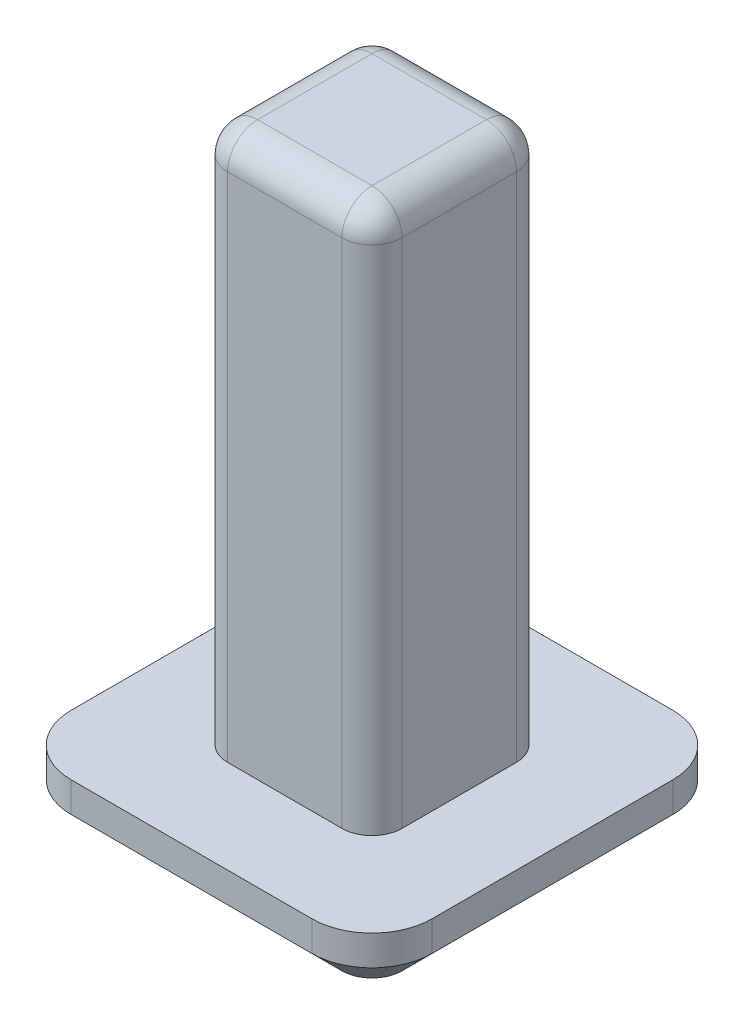
ISO-10303-21;
HEADER;
FILE_DESCRIPTION(('STEP AP214'),'2;1');
FILE_NAME('part.step','',(''),(''),'','','');
FILE_SCHEMA(('AUTOMOTIVE_DESIGN { 1 0 10303 214 1 1 1 1 }'));
ENDSEC;
DATA;
#1=APPLICATION_CONTEXT('core data for automotive mechanical design processes');
#2=APPLICATION_PROTOCOL_DEFINITION('international standard','automotive_design',2000,#1);
#3=PRODUCT_CONTEXT('',#1,'mechanical');
#4=PRODUCT('Part','Part','',(#3));
#5=PRODUCT_RELATED_PRODUCT_CATEGORY('part','',(#4));
#6=PRODUCT_DEFINITION_FORMATION('','',#4);
#7=PRODUCT_DEFINITION_CONTEXT('part definition',#1,'design');
#8=PRODUCT_DEFINITION('design','',#6,#7);
#9=PRODUCT_DEFINITION_SHAPE('','',#8);
#10=(LENGTH_UNIT() NAMED_UNIT(*) SI_UNIT(.MILLI.,.METRE.));
#11=(NAMED_UNIT(*) PLANE_ANGLE_UNIT() SI_UNIT($,.RADIAN.));
#12=(NAMED_UNIT(*) SI_UNIT($,.STERADIAN.) SOLID_ANGLE_UNIT());
#13=UNCERTAINTY_MEASURE_WITH_UNIT(LENGTH_MEASURE(1.E-05),#10,'distance_accuracy_value','');
#14=(GEOMETRIC_REPRESENTATION_CONTEXT(3) GLOBAL_UNCERTAINTY_ASSIGNED_CONTEXT((#13)) GLOBAL_UNIT_ASSIGNED_CONTEXT((#10,
#11,#12)) REPRESENTATION_CONTEXT('',''));
#15=CARTESIAN_POINT('',(0.,0.,0.));
#16=DIRECTION('',(0.,0.,1.));
#17=DIRECTION('',(1.,0.,0.));
#18=AXIS2_PLACEMENT_3D('',#15,#16,#17);
#19=CARTESIAN_POINT('',(0.,1.,0.));
#20=DIRECTION('',(0.,-1.,0.));
#21=DIRECTION('',(0.,0.,-1.));
#22=AXIS2_PLACEMENT_3D('',#19,#20,#21);
#23=PLANE('',#22);
#24=DIRECTION('',(0.,0.,1.));
#25=VECTOR('',#24,1.);
#26=CARTESIAN_POINT('',(-3.,1.,3.));
#27=LINE('',#26,#25);
#28=CARTESIAN_POINT('',(-3.,1.,-2.));
#29=VERTEX_POINT('',#28);
#30=CARTESIAN_POINT('',(-3.,1.,2.));
#31=VERTEX_POINT('',#30);
#32=EDGE_CURVE('E198',#29,#31,#27,.T.);
#33=ORIENTED_EDGE('',*,*,#32,.T.);
#34=CARTESIAN_POINT('',(-2.,1.,2.));
#35=DIRECTION('',(0.,-1.,0.));
#36=DIRECTION('',(0.,0.,-1.));
#37=AXIS2_PLACEMENT_3D('',#34,#35,#36);
#38=CIRCLE('',#37,1.);
#39=CARTESIAN_POINT('',(-2.,1.,3.));
#40=VERTEX_POINT('',#39);
#41=EDGE_CURVE('E192',#31,#40,#38,.F.);
#42=ORIENTED_EDGE('',*,*,#41,.T.);
#43=DIRECTION('',(1.,0.,0.));
#44=VECTOR('',#43,1.);
#45=CARTESIAN_POINT('',(-3.,1.,3.));
#46=LINE('',#45,#44);
#47=CARTESIAN_POINT('',(2.,1.,3.));
#48=VERTEX_POINT('',#47);
#49=EDGE_CURVE('E195',#40,#48,#46,.T.);
#50=ORIENTED_EDGE('',*,*,#49,.T.);
#51=CARTESIAN_POINT('',(2.,1.,2.));
#52=DIRECTION('',(0.,-1.,0.));
#53=DIRECTION('',(0.,0.,-1.));
#54=AXIS2_PLACEMENT_3D('',#51,#52,#53);
#55=CIRCLE('',#54,1.);
#56=CARTESIAN_POINT('',(3.,1.,2.));
#57=VERTEX_POINT('',#56);
#58=EDGE_CURVE('E215',#48,#57,#55,.F.);
#59=ORIENTED_EDGE('',*,*,#58,.T.);
#60=DIRECTION('',(0.,0.,-1.));
#61=VECTOR('',#60,1.);
#62=CARTESIAN_POINT('',(3.,1.,3.));
#63=LINE('',#62,#61);
#64=CARTESIAN_POINT('',(3.,1.,-2.));
#65=VERTEX_POINT('',#64);
#66=EDGE_CURVE('E391',#57,#65,#63,.T.);
#67=ORIENTED_EDGE('',*,*,#66,.T.);
#68=CARTESIAN_POINT('',(2.,1.,-2.));
#69=DIRECTION('',(0.,-1.,0.));
#70=DIRECTION('',(0.,0.,-1.));
#71=AXIS2_PLACEMENT_3D('',#68,#69,#70);
#72=CIRCLE('',#71,1.);
#73=CARTESIAN_POINT('',(2.,1.,-3.));
#74=VERTEX_POINT('',#73);
#75=EDGE_CURVE('E217',#65,#74,#72,.F.);
#76=ORIENTED_EDGE('',*,*,#75,.T.);
#77=DIRECTION('',(-1.,0.,0.));
#78=VECTOR('',#77,1.);
#79=CARTESIAN_POINT('',(-3.,1.,-3.));
#80=LINE('',#79,#78);
#81=CARTESIAN_POINT('',(-2.,1.,-3.));
#82=VERTEX_POINT('',#81);
#83=EDGE_CURVE('E389',#74,#82,#80,.T.);
#84=ORIENTED_EDGE('',*,*,#83,.T.);
#85=CARTESIAN_POINT('',(-2.,1.,-2.));
#86=DIRECTION('',(0.,-1.,0.));
#87=DIRECTION('',(0.,0.,-1.));
#88=AXIS2_PLACEMENT_3D('',#85,#86,#87);
#89=CIRCLE('',#88,1.);
#90=EDGE_CURVE('E200',#82,#29,#89,.F.);
#91=ORIENTED_EDGE('',*,*,#90,.T.);
#92=EDGE_LOOP('',(#33,#42,#50,#59,#67,#76,#84,#91));
#93=FACE_BOUND('',#92,.T.);
#94=DIRECTION('',(0.,0.,-1.));
#95=VECTOR('',#94,1.);
#96=CARTESIAN_POINT('',(1.45,1.,1.45));
#97=LINE('',#96,#95);
#98=CARTESIAN_POINT('',(1.45,1.,0.95));
#99=VERTEX_POINT('',#98);
#100=CARTESIAN_POINT('',(1.45,1.,-0.95));
#101=VERTEX_POINT('',#100);
#102=EDGE_CURVE('E306',#99,#101,#97,.T.);
#103=ORIENTED_EDGE('',*,*,#102,.F.);
#104=CARTESIAN_POINT('',(0.95,1.,0.95));
#105=DIRECTION('',(0.,-1.,0.));
#106=DIRECTION('',(0.,0.,-1.));
#107=AXIS2_PLACEMENT_3D('',#104,#105,#106);
#108=CIRCLE('',#107,0.5);
#109=CARTESIAN_POINT('',(0.95,1.,1.45));
#110=VERTEX_POINT('',#109);
#111=EDGE_CURVE('E253',#99,#110,#108,.T.);
#112=ORIENTED_EDGE('',*,*,#111,.T.);
#113=DIRECTION('',(1.,0.,0.));
#114=VECTOR('',#113,1.);
#115=CARTESIAN_POINT('',(-1.45,1.,1.45));
#116=LINE('',#115,#114);
#117=CARTESIAN_POINT('',(-0.95,1.,1.45));
#118=VERTEX_POINT('',#117);
#119=EDGE_CURVE('E395',#118,#110,#116,.T.);
#120=ORIENTED_EDGE('',*,*,#119,.F.);
#121=CARTESIAN_POINT('',(-0.95,1.,0.95));
#122=DIRECTION('',(0.,-1.,0.));
#123=DIRECTION('',(0.,0.,-1.));
#124=AXIS2_PLACEMENT_3D('',#121,#122,#123);
#125=CIRCLE('',#124,0.5);
#126=CARTESIAN_POINT('',(-1.45,1.,0.95));
#127=VERTEX_POINT('',#126);
#128=EDGE_CURVE('E255',#118,#127,#125,.T.);
#129=ORIENTED_EDGE('',*,*,#128,.T.);
#130=DIRECTION('',(0.,0.,1.));
#131=VECTOR('',#130,1.);
#132=CARTESIAN_POINT('',(-1.45,1.,1.45));
#133=LINE('',#132,#131);
#134=CARTESIAN_POINT('',(-1.45,1.,-0.95));
#135=VERTEX_POINT('',#134);
#136=EDGE_CURVE('E400',#135,#127,#133,.T.);
#137=ORIENTED_EDGE('',*,*,#136,.F.);
#138=CARTESIAN_POINT('',(-0.95,1.,-0.95));
#139=DIRECTION('',(0.,-1.,0.));
#140=DIRECTION('',(0.,0.,-1.));
#141=AXIS2_PLACEMENT_3D('',#138,#139,#140);
#142=CIRCLE('',#141,0.5);
#143=CARTESIAN_POINT('',(-0.95,1.,-1.45));
#144=VERTEX_POINT('',#143);
#145=EDGE_CURVE('E251',#135,#144,#142,.T.);
#146=ORIENTED_EDGE('',*,*,#145,.T.);
#147=DIRECTION('',(-1.,0.,0.));
#148=VECTOR('',#147,1.);
#149=CARTESIAN_POINT('',(-1.45,1.,-1.45));
#150=LINE('',#149,#148);
#151=CARTESIAN_POINT('',(0.95,1.,-1.45));
#152=VERTEX_POINT('',#151);
#153=EDGE_CURVE('E403',#152,#144,#150,.T.);
#154=ORIENTED_EDGE('',*,*,#153,.F.);
#155=CARTESIAN_POINT('',(0.95,1.,-0.95));
#156=DIRECTION('',(0.,-1.,0.));
#157=DIRECTION('',(0.,0.,-1.));
#158=AXIS2_PLACEMENT_3D('',#155,#156,#157);
#159=CIRCLE('',#158,0.5);
#160=EDGE_CURVE('E249',#152,#101,#159,.T.);
#161=ORIENTED_EDGE('',*,*,#160,.T.);
#162=EDGE_LOOP('',(#103,#112,#120,#129,#137,#146,#154,#161));
#163=FACE_BOUND('',#162,.T.);
#164=ADVANCED_FACE('F40',(#93,#163),#23,.F.);
#165=CARTESIAN_POINT('',(3.,1.,3.));
#166=DIRECTION('',(-1.,0.,0.));
#167=DIRECTION('',(0.,0.,1.));
#168=AXIS2_PLACEMENT_3D('',#165,#166,#167);
#169=PLANE('',#168);
#170=DIRECTION('',(0.,-1.,0.));
#171=VECTOR('',#170,1.);
#172=CARTESIAN_POINT('',(3.,1.,2.));
#173=LINE('',#172,#171);
#174=CARTESIAN_POINT('',(3.,0.499999999999999,2.));
#175=VERTEX_POINT('',#174);
#176=EDGE_CURVE('E224',#57,#175,#173,.T.);
#177=ORIENTED_EDGE('',*,*,#176,.T.);
#178=DIRECTION('',(0.,0.,-1.));
#179=VECTOR('',#178,1.);
#180=CARTESIAN_POINT('',(3.,0.499999999999999,-2.));
#181=LINE('',#180,#179);
#182=CARTESIAN_POINT('',(3.,0.499999999999999,-2.));
#183=VERTEX_POINT('',#182);
#184=EDGE_CURVE('E332',#175,#183,#181,.T.);
#185=ORIENTED_EDGE('',*,*,#184,.T.);
#186=DIRECTION('',(0.,-1.,0.));
#187=VECTOR('',#186,1.);
#188=CARTESIAN_POINT('',(3.,1.,-2.));
#189=LINE('',#188,#187);
#190=EDGE_CURVE('E227',#183,#65,#189,.F.);
#191=ORIENTED_EDGE('',*,*,#190,.T.);
#192=ORIENTED_EDGE('',*,*,#66,.F.);
#193=EDGE_LOOP('',(#177,#185,#191,#192));
#194=FACE_BOUND('',#193,.T.);
#195=ADVANCED_FACE('F475',(#194),#169,.F.);
#196=CARTESIAN_POINT('',(-3.,1.,-3.));
#197=DIRECTION('',(0.,0.,1.));
#198=DIRECTION('',(1.,0.,0.));
#199=AXIS2_PLACEMENT_3D('',#196,#197,#198);
#200=PLANE('',#199);
#201=DIRECTION('',(0.,-1.,0.));
#202=VECTOR('',#201,1.);
#203=CARTESIAN_POINT('',(2.,1.,-3.));
#204=LINE('',#203,#202);
#205=CARTESIAN_POINT('',(2.,0.499999999999999,-3.));
#206=VERTEX_POINT('',#205);
#207=EDGE_CURVE('E199',#74,#206,#204,.T.);
#208=ORIENTED_EDGE('',*,*,#207,.T.);
#209=DIRECTION('',(-1.,0.,0.));
#210=VECTOR('',#209,1.);
#211=CARTESIAN_POINT('',(-2.,0.499999999999999,-3.));
#212=LINE('',#211,#210);
#213=CARTESIAN_POINT('',(-2.,0.499999999999999,-3.));
#214=VERTEX_POINT('',#213);
#215=EDGE_CURVE('E283',#206,#214,#212,.T.);
#216=ORIENTED_EDGE('',*,*,#215,.T.);
#217=DIRECTION('',(0.,-1.,0.));
#218=VECTOR('',#217,1.);
#219=CARTESIAN_POINT('',(-2.,1.,-3.));
#220=LINE('',#219,#218);
#221=EDGE_CURVE('E222',#214,#82,#220,.F.);
#222=ORIENTED_EDGE('',*,*,#221,.T.);
#223=ORIENTED_EDGE('',*,*,#83,.F.);
#224=EDGE_LOOP('',(#208,#216,#222,#223));
#225=FACE_BOUND('',#224,.T.);
#226=ADVANCED_FACE('F386',(#225),#200,.F.);
#227=CARTESIAN_POINT('',(-3.,1.,3.));
#228=DIRECTION('',(1.,0.,0.));
#229=DIRECTION('',(0.,0.,-1.));
#230=AXIS2_PLACEMENT_3D('',#227,#228,#229);
#231=PLANE('',#230);
#232=DIRECTION('',(0.,-1.,0.));
#233=VECTOR('',#232,1.);
#234=CARTESIAN_POINT('',(-3.,1.,-2.));
#235=LINE('',#234,#233);
#236=CARTESIAN_POINT('',(-3.,0.499999999999999,-2.));
#237=VERTEX_POINT('',#236);
#238=EDGE_CURVE('E207',#29,#237,#235,.T.);
#239=ORIENTED_EDGE('',*,*,#238,.T.);
#240=DIRECTION('',(0.,0.,1.));
#241=VECTOR('',#240,1.);
#242=CARTESIAN_POINT('',(-3.,0.499999999999999,2.));
#243=LINE('',#242,#241);
#244=CARTESIAN_POINT('',(-3.,0.499999999999999,2.));
#245=VERTEX_POINT('',#244);
#246=EDGE_CURVE('E330',#237,#245,#243,.T.);
#247=ORIENTED_EDGE('',*,*,#246,.T.);
#248=DIRECTION('',(0.,-1.,0.));
#249=VECTOR('',#248,1.);
#250=CARTESIAN_POINT('',(-3.,1.,2.));
#251=LINE('',#250,#249);
#252=EDGE_CURVE('E210',#245,#31,#251,.F.);
#253=ORIENTED_EDGE('',*,*,#252,.T.);
#254=ORIENTED_EDGE('',*,*,#32,.F.);
#255=EDGE_LOOP('',(#239,#247,#253,#254));
#256=FACE_BOUND('',#255,.T.);
#257=ADVANCED_FACE('F487',(#256),#231,.F.);
#258=CARTESIAN_POINT('',(-3.,1.,3.));
#259=DIRECTION('',(0.,0.,-1.));
#260=DIRECTION('',(-1.,0.,0.));
#261=AXIS2_PLACEMENT_3D('',#258,#259,#260);
#262=PLANE('',#261);
#263=DIRECTION('',(0.,-1.,0.));
#264=VECTOR('',#263,1.);
#265=CARTESIAN_POINT('',(-2.,1.,3.));
#266=LINE('',#265,#264);
#267=CARTESIAN_POINT('',(-2.,0.499999999999999,3.));
#268=VERTEX_POINT('',#267);
#269=EDGE_CURVE('E203',#40,#268,#266,.T.);
#270=ORIENTED_EDGE('',*,*,#269,.T.);
#271=DIRECTION('',(1.,0.,0.));
#272=VECTOR('',#271,1.);
#273=CARTESIAN_POINT('',(2.,0.499999999999999,3.));
#274=LINE('',#273,#272);
#275=CARTESIAN_POINT('',(2.,0.499999999999999,3.));
#276=VERTEX_POINT('',#275);
#277=EDGE_CURVE('E11',#268,#276,#274,.T.);
#278=ORIENTED_EDGE('',*,*,#277,.T.);
#279=DIRECTION('',(0.,-1.,0.));
#280=VECTOR('',#279,1.);
#281=CARTESIAN_POINT('',(2.,1.,3.));
#282=LINE('',#281,#280);
#283=EDGE_CURVE('E204',#276,#48,#282,.F.);
#284=ORIENTED_EDGE('',*,*,#283,.T.);
#285=ORIENTED_EDGE('',*,*,#49,.F.);
#286=EDGE_LOOP('',(#270,#278,#284,#285));
#287=FACE_BOUND('',#286,.T.);
#288=ADVANCED_FACE('F202',(#287),#262,.F.);
#289=CARTESIAN_POINT('',(0.,0.,0.));
#290=DIRECTION('',(0.,-1.,0.));
#291=DIRECTION('',(0.,0.,-1.));
#292=AXIS2_PLACEMENT_3D('',#289,#290,#291);
#293=PLANE('',#292);
#294=CARTESIAN_POINT('',(-2.,0.,-2.));
#295=DIRECTION('',(0.,-1.,0.));
#296=DIRECTION('',(0.,0.,-1.));
#297=AXIS2_PLACEMENT_3D('',#294,#295,#296);
#298=CIRCLE('',#297,0.499999999999998);
#299=CARTESIAN_POINT('',(-2.5,0.,-2.));
#300=VERTEX_POINT('',#299);
#301=CARTESIAN_POINT('',(-2.,0.,-2.5));
#302=VERTEX_POINT('',#301);
#303=EDGE_CURVE('E321',#300,#302,#298,.T.);
#304=ORIENTED_EDGE('',*,*,#303,.T.);
#305=DIRECTION('',(1.,0.,0.));
#306=VECTOR('',#305,1.);
#307=CARTESIAN_POINT('',(2.,0.,-2.5));
#308=LINE('',#307,#306);
#309=CARTESIAN_POINT('',(2.,0.,-2.5));
#310=VERTEX_POINT('',#309);
#311=EDGE_CURVE('E323',#302,#310,#308,.T.);
#312=ORIENTED_EDGE('',*,*,#311,.T.);
#313=CARTESIAN_POINT('',(2.,0.,-2.));
#314=DIRECTION('',(0.,-1.,0.));
#315=DIRECTION('',(0.,0.,-1.));
#316=AXIS2_PLACEMENT_3D('',#313,#314,#315);
#317=CIRCLE('',#316,0.499999999999998);
#318=CARTESIAN_POINT('',(2.5,0.,-2.));
#319=VERTEX_POINT('',#318);
#320=EDGE_CURVE('E319',#310,#319,#317,.T.);
#321=ORIENTED_EDGE('',*,*,#320,.T.);
#322=DIRECTION('',(0.,0.,1.));
#323=VECTOR('',#322,1.);
#324=CARTESIAN_POINT('',(2.5,0.,2.));
#325=LINE('',#324,#323);
#326=CARTESIAN_POINT('',(2.5,0.,2.));
#327=VERTEX_POINT('',#326);
#328=EDGE_CURVE('E315',#319,#327,#325,.T.);
#329=ORIENTED_EDGE('',*,*,#328,.T.);
#330=CARTESIAN_POINT('',(2.,0.,2.));
#331=DIRECTION('',(0.,-1.,0.));
#332=DIRECTION('',(0.,0.,-1.));
#333=AXIS2_PLACEMENT_3D('',#330,#331,#332);
#334=CIRCLE('',#333,0.499999999999998);
#335=CARTESIAN_POINT('',(2.,0.,2.5));
#336=VERTEX_POINT('',#335);
#337=EDGE_CURVE('E311',#327,#336,#334,.T.);
#338=ORIENTED_EDGE('',*,*,#337,.T.);
#339=DIRECTION('',(-1.,0.,0.));
#340=VECTOR('',#339,1.);
#341=CARTESIAN_POINT('',(-2.,0.,2.5));
#342=LINE('',#341,#340);
#343=CARTESIAN_POINT('',(-2.,0.,2.5));
#344=VERTEX_POINT('',#343);
#345=EDGE_CURVE('E309',#336,#344,#342,.T.);
#346=ORIENTED_EDGE('',*,*,#345,.T.);
#347=CARTESIAN_POINT('',(-2.,0.,2.));
#348=DIRECTION('',(0.,-1.,0.));
#349=DIRECTION('',(0.,0.,-1.));
#350=AXIS2_PLACEMENT_3D('',#347,#348,#349);
#351=CIRCLE('',#350,0.499999999999998);
#352=CARTESIAN_POINT('',(-2.5,0.,2.));
#353=VERTEX_POINT('',#352);
#354=EDGE_CURVE('E313',#344,#353,#351,.T.);
#355=ORIENTED_EDGE('',*,*,#354,.T.);
#356=DIRECTION('',(0.,0.,-1.));
#357=VECTOR('',#356,1.);
#358=CARTESIAN_POINT('',(-2.5,0.,-2.));
#359=LINE('',#358,#357);
#360=EDGE_CURVE('E317',#353,#300,#359,.T.);
#361=ORIENTED_EDGE('',*,*,#360,.T.);
#362=EDGE_LOOP('',(#304,#312,#321,#329,#338,#346,#355,#361));
#363=FACE_BOUND('',#362,.T.);
#364=ADVANCED_FACE('F366',(#363),#293,.T.);
#365=CARTESIAN_POINT('',(-2.,1.,2.));
#366=DIRECTION('',(0.,-1.,0.));
#367=DIRECTION('',(0.,0.,-1.));
#368=AXIS2_PLACEMENT_3D('',#365,#366,#367);
#369=CYLINDRICAL_SURFACE('',#368,1.);
#370=ORIENTED_EDGE('',*,*,#252,.F.);
#371=CARTESIAN_POINT('',(-2.,0.499999999999999,2.));
#372=DIRECTION('',(0.,-1.,0.));
#373=DIRECTION('',(0.,0.,-1.));
#374=AXIS2_PLACEMENT_3D('',#371,#372,#373);
#375=CIRCLE('',#374,1.);
#376=EDGE_CURVE('E63',#245,#268,#375,.F.);
#377=ORIENTED_EDGE('',*,*,#376,.T.);
#378=ORIENTED_EDGE('',*,*,#269,.F.);
#379=ORIENTED_EDGE('',*,*,#41,.F.);
#380=EDGE_LOOP('',(#370,#377,#378,#379));
#381=FACE_BOUND('',#380,.T.);
#382=ADVANCED_FACE('F206',(#381),#369,.T.);
#383=CARTESIAN_POINT('',(-2.,1.,-2.));
#384=DIRECTION('',(0.,-1.,0.));
#385=DIRECTION('',(0.,0.,-1.));
#386=AXIS2_PLACEMENT_3D('',#383,#384,#385);
#387=CYLINDRICAL_SURFACE('',#386,1.);
#388=ORIENTED_EDGE('',*,*,#221,.F.);
#389=CARTESIAN_POINT('',(-2.,0.499999999999999,-2.));
#390=DIRECTION('',(0.,-1.,0.));
#391=DIRECTION('',(0.,0.,-1.));
#392=AXIS2_PLACEMENT_3D('',#389,#390,#391);
#393=CIRCLE('',#392,1.);
#394=EDGE_CURVE('E326',#214,#237,#393,.F.);
#395=ORIENTED_EDGE('',*,*,#394,.T.);
#396=ORIENTED_EDGE('',*,*,#238,.F.);
#397=ORIENTED_EDGE('',*,*,#90,.F.);
#398=EDGE_LOOP('',(#388,#395,#396,#397));
#399=FACE_BOUND('',#398,.T.);
#400=ADVANCED_FACE('F495',(#399),#387,.T.);
#401=CARTESIAN_POINT('',(2.,1.,-2.));
#402=DIRECTION('',(0.,-1.,0.));
#403=DIRECTION('',(0.,0.,-1.));
#404=AXIS2_PLACEMENT_3D('',#401,#402,#403);
#405=CYLINDRICAL_SURFACE('',#404,1.);
#406=ORIENTED_EDGE('',*,*,#190,.F.);
#407=CARTESIAN_POINT('',(2.,0.499999999999999,-2.));
#408=DIRECTION('',(0.,-1.,0.));
#409=DIRECTION('',(0.,0.,-1.));
#410=AXIS2_PLACEMENT_3D('',#407,#408,#409);
#411=CIRCLE('',#410,1.);
#412=EDGE_CURVE('E328',#183,#206,#411,.F.);
#413=ORIENTED_EDGE('',*,*,#412,.T.);
#414=ORIENTED_EDGE('',*,*,#207,.F.);
#415=ORIENTED_EDGE('',*,*,#75,.F.);
#416=EDGE_LOOP('',(#406,#413,#414,#415));
#417=FACE_BOUND('',#416,.T.);
#418=ADVANCED_FACE('F382',(#417),#405,.T.);
#419=CARTESIAN_POINT('',(2.,1.,2.));
#420=DIRECTION('',(0.,-1.,0.));
#421=DIRECTION('',(0.,0.,-1.));
#422=AXIS2_PLACEMENT_3D('',#419,#420,#421);
#423=CYLINDRICAL_SURFACE('',#422,1.);
#424=ORIENTED_EDGE('',*,*,#283,.F.);
#425=CARTESIAN_POINT('',(2.,0.499999999999999,2.));
#426=DIRECTION('',(0.,-1.,0.));
#427=DIRECTION('',(0.,0.,-1.));
#428=AXIS2_PLACEMENT_3D('',#425,#426,#427);
#429=CIRCLE('',#428,1.);
#430=EDGE_CURVE('E49',#276,#175,#429,.F.);
#431=ORIENTED_EDGE('',*,*,#430,.T.);
#432=ORIENTED_EDGE('',*,*,#176,.F.);
#433=ORIENTED_EDGE('',*,*,#58,.F.);
#434=EDGE_LOOP('',(#424,#431,#432,#433));
#435=FACE_BOUND('',#434,.T.);
#436=ADVANCED_FACE('F472',(#435),#423,.T.);
#437=CARTESIAN_POINT('',(1.45,10.,1.45));
#438=DIRECTION('',(-1.,0.,0.));
#439=DIRECTION('',(0.,0.,1.));
#440=AXIS2_PLACEMENT_3D('',#437,#438,#439);
#441=PLANE('',#440);
#442=DIRECTION('',(0.,-1.,0.));
#443=VECTOR('',#442,1.);
#444=CARTESIAN_POINT('',(1.45,10.,-0.95));
#445=LINE('',#444,#443);
#446=CARTESIAN_POINT('',(1.45,9.5,-0.95));
#447=VERTEX_POINT('',#446);
#448=EDGE_CURVE('E236',#101,#447,#445,.F.);
#449=ORIENTED_EDGE('',*,*,#448,.T.);
#450=DIRECTION('',(0.,0.,-1.));
#451=VECTOR('',#450,1.);
#452=CARTESIAN_POINT('',(1.45,9.5,1.45));
#453=LINE('',#452,#451);
#454=CARTESIAN_POINT('',(1.45,9.5,0.95));
#455=VERTEX_POINT('',#454);
#456=EDGE_CURVE('E277',#447,#455,#453,.F.);
#457=ORIENTED_EDGE('',*,*,#456,.T.);
#458=DIRECTION('',(0.,-1.,0.));
#459=VECTOR('',#458,1.);
#460=CARTESIAN_POINT('',(1.45,10.,0.95));
#461=LINE('',#460,#459);
#462=EDGE_CURVE('E234',#455,#99,#461,.T.);
#463=ORIENTED_EDGE('',*,*,#462,.T.);
#464=ORIENTED_EDGE('',*,*,#102,.T.);
#465=EDGE_LOOP('',(#449,#457,#463,#464));
#466=FACE_BOUND('',#465,.T.);
#467=ADVANCED_FACE('F410',(#466),#441,.F.);
#468=CARTESIAN_POINT('',(-1.45,10.,-1.45));
#469=DIRECTION('',(0.,0.,1.));
#470=DIRECTION('',(1.,0.,0.));
#471=AXIS2_PLACEMENT_3D('',#468,#469,#470);
#472=PLANE('',#471);
#473=DIRECTION('',(0.,-1.,0.));
#474=VECTOR('',#473,1.);
#475=CARTESIAN_POINT('',(-0.95,10.,-1.45));
#476=LINE('',#475,#474);
#477=CARTESIAN_POINT('',(-0.95,9.5,-1.45));
#478=VERTEX_POINT('',#477);
#479=EDGE_CURVE('E229',#144,#478,#476,.F.);
#480=ORIENTED_EDGE('',*,*,#479,.T.);
#481=DIRECTION('',(-1.,0.,0.));
#482=VECTOR('',#481,1.);
#483=CARTESIAN_POINT('',(-1.45,9.5,-1.45));
#484=LINE('',#483,#482);
#485=CARTESIAN_POINT('',(0.95,9.5,-1.45));
#486=VERTEX_POINT('',#485);
#487=EDGE_CURVE('E273',#478,#486,#484,.F.);
#488=ORIENTED_EDGE('',*,*,#487,.T.);
#489=DIRECTION('',(0.,-1.,0.));
#490=VECTOR('',#489,1.);
#491=CARTESIAN_POINT('',(0.95,10.,-1.45));
#492=LINE('',#491,#490);
#493=EDGE_CURVE('E232',#486,#152,#492,.T.);
#494=ORIENTED_EDGE('',*,*,#493,.T.);
#495=ORIENTED_EDGE('',*,*,#153,.T.);
#496=EDGE_LOOP('',(#480,#488,#494,#495));
#497=FACE_BOUND('',#496,.T.);
#498=ADVANCED_FACE('F464',(#497),#472,.F.);
#499=CARTESIAN_POINT('',(-1.45,10.,1.45));
#500=DIRECTION('',(1.,0.,0.));
#501=DIRECTION('',(0.,0.,-1.));
#502=AXIS2_PLACEMENT_3D('',#499,#500,#501);
#503=PLANE('',#502);
#504=DIRECTION('',(0.,-1.,0.));
#505=VECTOR('',#504,1.);
#506=CARTESIAN_POINT('',(-1.45,10.,0.95));
#507=LINE('',#506,#505);
#508=CARTESIAN_POINT('',(-1.45,9.5,0.95));
#509=VERTEX_POINT('',#508);
#510=EDGE_CURVE('E239',#127,#509,#507,.F.);
#511=ORIENTED_EDGE('',*,*,#510,.T.);
#512=DIRECTION('',(0.,0.,1.));
#513=VECTOR('',#512,1.);
#514=CARTESIAN_POINT('',(-1.45,9.5,1.45));
#515=LINE('',#514,#513);
#516=CARTESIAN_POINT('',(-1.45,9.5,-0.95));
#517=VERTEX_POINT('',#516);
#518=EDGE_CURVE('E269',#509,#517,#515,.F.);
#519=ORIENTED_EDGE('',*,*,#518,.T.);
#520=DIRECTION('',(0.,-1.,0.));
#521=VECTOR('',#520,1.);
#522=CARTESIAN_POINT('',(-1.45,10.,-0.95));
#523=LINE('',#522,#521);
#524=EDGE_CURVE('E242',#517,#135,#523,.T.);
#525=ORIENTED_EDGE('',*,*,#524,.T.);
#526=ORIENTED_EDGE('',*,*,#136,.T.);
#527=EDGE_LOOP('',(#511,#519,#525,#526));
#528=FACE_BOUND('',#527,.T.);
#529=ADVANCED_FACE('F455',(#528),#503,.F.);
#530=CARTESIAN_POINT('',(-1.45,10.,1.45));
#531=DIRECTION('',(0.,0.,-1.));
#532=DIRECTION('',(-1.,0.,0.));
#533=AXIS2_PLACEMENT_3D('',#530,#531,#532);
#534=PLANE('',#533);
#535=DIRECTION('',(0.,-1.,0.));
#536=VECTOR('',#535,1.);
#537=CARTESIAN_POINT('',(0.95,10.,1.45));
#538=LINE('',#537,#536);
#539=CARTESIAN_POINT('',(0.95,9.5,1.45));
#540=VERTEX_POINT('',#539);
#541=EDGE_CURVE('E246',#110,#540,#538,.F.);
#542=ORIENTED_EDGE('',*,*,#541,.T.);
#543=DIRECTION('',(1.,0.,0.));
#544=VECTOR('',#543,1.);
#545=CARTESIAN_POINT('',(-1.45,9.5,1.45));
#546=LINE('',#545,#544);
#547=CARTESIAN_POINT('',(-0.95,9.5,1.45));
#548=VERTEX_POINT('',#547);
#549=EDGE_CURVE('E281',#540,#548,#546,.F.);
#550=ORIENTED_EDGE('',*,*,#549,.T.);
#551=DIRECTION('',(0.,-1.,0.));
#552=VECTOR('',#551,1.);
#553=CARTESIAN_POINT('',(-0.95,10.,1.45));
#554=LINE('',#553,#552);
#555=EDGE_CURVE('E244',#548,#118,#554,.T.);
#556=ORIENTED_EDGE('',*,*,#555,.T.);
#557=ORIENTED_EDGE('',*,*,#119,.T.);
#558=EDGE_LOOP('',(#542,#550,#556,#557));
#559=FACE_BOUND('',#558,.T.);
#560=ADVANCED_FACE('F444',(#559),#534,.F.);
#561=CARTESIAN_POINT('',(0.,10.,0.));
#562=DIRECTION('',(0.,-1.,0.));
#563=DIRECTION('',(0.,0.,-1.));
#564=AXIS2_PLACEMENT_3D('',#561,#562,#563);
#565=PLANE('',#564);
#566=DIRECTION('',(-1.,0.,0.));
#567=VECTOR('',#566,1.);
#568=CARTESIAN_POINT('',(0.,10.,-0.95));
#569=LINE('',#568,#567);
#570=CARTESIAN_POINT('',(0.95,10.,-0.95));
#571=VERTEX_POINT('',#570);
#572=CARTESIAN_POINT('',(-0.95,10.,-0.95));
#573=VERTEX_POINT('',#572);
#574=EDGE_CURVE('E264',#571,#573,#569,.T.);
#575=ORIENTED_EDGE('',*,*,#574,.T.);
#576=DIRECTION('',(0.,0.,1.));
#577=VECTOR('',#576,1.);
#578=CARTESIAN_POINT('',(-0.95,10.,0.));
#579=LINE('',#578,#577);
#580=CARTESIAN_POINT('',(-0.95,10.,0.95));
#581=VERTEX_POINT('',#580);
#582=EDGE_CURVE('E266',#573,#581,#579,.T.);
#583=ORIENTED_EDGE('',*,*,#582,.T.);
#584=DIRECTION('',(1.,0.,0.));
#585=VECTOR('',#584,1.);
#586=CARTESIAN_POINT('',(0.,10.,0.95));
#587=LINE('',#586,#585);
#588=CARTESIAN_POINT('',(0.95,10.,0.95));
#589=VERTEX_POINT('',#588);
#590=EDGE_CURVE('E260',#581,#589,#587,.T.);
#591=ORIENTED_EDGE('',*,*,#590,.T.);
#592=DIRECTION('',(0.,0.,-1.));
#593=VECTOR('',#592,1.);
#594=CARTESIAN_POINT('',(0.95,10.,0.));
#595=LINE('',#594,#593);
#596=EDGE_CURVE('E262',#589,#571,#595,.T.);
#597=ORIENTED_EDGE('',*,*,#596,.T.);
#598=EDGE_LOOP('',(#575,#583,#591,#597));
#599=FACE_BOUND('',#598,.T.);
#600=ADVANCED_FACE('F431',(#599),#565,.F.);
#601=CARTESIAN_POINT('',(0.95,10.,-0.95));
#602=DIRECTION('',(0.,-1.,0.));
#603=DIRECTION('',(0.,0.,-1.));
#604=AXIS2_PLACEMENT_3D('',#601,#602,#603);
#605=CYLINDRICAL_SURFACE('',#604,0.5);
#606=ORIENTED_EDGE('',*,*,#493,.F.);
#607=CARTESIAN_POINT('',(0.95,9.5,-0.95));
#608=DIRECTION('',(0.,-1.,0.));
#609=DIRECTION('',(0.,0.,-1.));
#610=AXIS2_PLACEMENT_3D('',#607,#608,#609);
#611=CIRCLE('',#610,0.5);
#612=EDGE_CURVE('E275',#486,#447,#611,.T.);
#613=ORIENTED_EDGE('',*,*,#612,.T.);
#614=ORIENTED_EDGE('',*,*,#448,.F.);
#615=ORIENTED_EDGE('',*,*,#160,.F.);
#616=EDGE_LOOP('',(#606,#613,#614,#615));
#617=FACE_BOUND('',#616,.T.);
#618=ADVANCED_FACE('F417',(#617),#605,.T.);
#619=CARTESIAN_POINT('',(-0.95,10.,-0.95));
#620=DIRECTION('',(0.,-1.,0.));
#621=DIRECTION('',(0.,0.,-1.));
#622=AXIS2_PLACEMENT_3D('',#619,#620,#621);
#623=CYLINDRICAL_SURFACE('',#622,0.5);
#624=ORIENTED_EDGE('',*,*,#524,.F.);
#625=CARTESIAN_POINT('',(-0.95,9.5,-0.95));
#626=DIRECTION('',(0.,-1.,0.));
#627=DIRECTION('',(0.,0.,-1.));
#628=AXIS2_PLACEMENT_3D('',#625,#626,#627);
#629=CIRCLE('',#628,0.5);
#630=EDGE_CURVE('E271',#517,#478,#629,.T.);
#631=ORIENTED_EDGE('',*,*,#630,.T.);
#632=ORIENTED_EDGE('',*,*,#479,.F.);
#633=ORIENTED_EDGE('',*,*,#145,.F.);
#634=EDGE_LOOP('',(#624,#631,#632,#633));
#635=FACE_BOUND('',#634,.T.);
#636=ADVANCED_FACE('F462',(#635),#623,.T.);
#637=CARTESIAN_POINT('',(0.95,10.,0.95));
#638=DIRECTION('',(0.,-1.,0.));
#639=DIRECTION('',(0.,0.,-1.));
#640=AXIS2_PLACEMENT_3D('',#637,#638,#639);
#641=CYLINDRICAL_SURFACE('',#640,0.5);
#642=ORIENTED_EDGE('',*,*,#462,.F.);
#643=CARTESIAN_POINT('',(0.95,9.5,0.95));
#644=DIRECTION('',(0.,-1.,0.));
#645=DIRECTION('',(0.,0.,-1.));
#646=AXIS2_PLACEMENT_3D('',#643,#644,#645);
#647=CIRCLE('',#646,0.5);
#648=EDGE_CURVE('E279',#455,#540,#647,.T.);
#649=ORIENTED_EDGE('',*,*,#648,.T.);
#650=ORIENTED_EDGE('',*,*,#541,.F.);
#651=ORIENTED_EDGE('',*,*,#111,.F.);
#652=EDGE_LOOP('',(#642,#649,#650,#651));
#653=FACE_BOUND('',#652,.T.);
#654=ADVANCED_FACE('F440',(#653),#641,.T.);
#655=CARTESIAN_POINT('',(-0.95,10.,0.95));
#656=DIRECTION('',(0.,-1.,0.));
#657=DIRECTION('',(0.,0.,-1.));
#658=AXIS2_PLACEMENT_3D('',#655,#656,#657);
#659=CYLINDRICAL_SURFACE('',#658,0.5);
#660=ORIENTED_EDGE('',*,*,#555,.F.);
#661=CARTESIAN_POINT('',(-0.95,9.5,0.95));
#662=DIRECTION('',(0.,-1.,0.));
#663=DIRECTION('',(0.,0.,-1.));
#664=AXIS2_PLACEMENT_3D('',#661,#662,#663);
#665=CIRCLE('',#664,0.5);
#666=EDGE_CURVE('E257',#548,#509,#665,.T.);
#667=ORIENTED_EDGE('',*,*,#666,.T.);
#668=ORIENTED_EDGE('',*,*,#510,.F.);
#669=ORIENTED_EDGE('',*,*,#128,.F.);
#670=EDGE_LOOP('',(#660,#667,#668,#669));
#671=FACE_BOUND('',#670,.T.);
#672=ADVANCED_FACE('F452',(#671),#659,.T.);
#673=CARTESIAN_POINT('',(0.95,9.5,-0.95));
#674=DIRECTION('',(0.,-1.,0.));
#675=DIRECTION('',(0.,0.,-1.));
#676=AXIS2_PLACEMENT_3D('',#673,#674,#675);
#677=SPHERICAL_SURFACE('',#676,0.5);
#678=CARTESIAN_POINT('',(0.95,9.5,-0.95));
#679=DIRECTION('',(0.,0.,1.));
#680=DIRECTION('',(1.,0.,0.));
#681=AXIS2_PLACEMENT_3D('',#678,#679,#680);
#682=CIRCLE('',#681,0.5);
#683=EDGE_CURVE('E300',#447,#571,#682,.T.);
#684=ORIENTED_EDGE('',*,*,#683,.F.);
#685=ORIENTED_EDGE('',*,*,#612,.F.);
#686=CARTESIAN_POINT('',(0.95,9.5,-0.95));
#687=DIRECTION('',(-1.,0.,0.));
#688=DIRECTION('',(0.,0.,1.));
#689=AXIS2_PLACEMENT_3D('',#686,#687,#688);
#690=CIRCLE('',#689,0.5);
#691=EDGE_CURVE('E303',#571,#486,#690,.T.);
#692=ORIENTED_EDGE('',*,*,#691,.F.);
#693=EDGE_LOOP('',(#684,#685,#692));
#694=FACE_BOUND('',#693,.T.);
#695=ADVANCED_FACE('F422',(#694),#677,.T.);
#696=CARTESIAN_POINT('',(0.,9.5,-0.95));
#697=DIRECTION('',(-1.,0.,0.));
#698=DIRECTION('',(0.,0.,1.));
#699=AXIS2_PLACEMENT_3D('',#696,#697,#698);
#700=CYLINDRICAL_SURFACE('',#699,0.5);
#701=ORIENTED_EDGE('',*,*,#691,.T.);
#702=ORIENTED_EDGE('',*,*,#487,.F.);
#703=CARTESIAN_POINT('',(-0.95,9.5,-0.95));
#704=DIRECTION('',(-1.,0.,0.));
#705=DIRECTION('',(0.,0.,1.));
#706=AXIS2_PLACEMENT_3D('',#703,#704,#705);
#707=CIRCLE('',#706,0.5);
#708=EDGE_CURVE('E297',#573,#478,#707,.T.);
#709=ORIENTED_EDGE('',*,*,#708,.F.);
#710=ORIENTED_EDGE('',*,*,#574,.F.);
#711=EDGE_LOOP('',(#701,#702,#709,#710));
#712=FACE_BOUND('',#711,.T.);
#713=ADVANCED_FACE('F427',(#712),#700,.T.);
#714=CARTESIAN_POINT('',(0.95,9.5,0.));
#715=DIRECTION('',(0.,0.,-1.));
#716=DIRECTION('',(-1.,0.,0.));
#717=AXIS2_PLACEMENT_3D('',#714,#715,#716);
#718=CYLINDRICAL_SURFACE('',#717,0.5);
#719=ORIENTED_EDGE('',*,*,#683,.T.);
#720=ORIENTED_EDGE('',*,*,#596,.F.);
#721=CARTESIAN_POINT('',(0.95,9.5,0.95));
#722=DIRECTION('',(0.,0.,1.));
#723=DIRECTION('',(1.,0.,0.));
#724=AXIS2_PLACEMENT_3D('',#721,#722,#723);
#725=CIRCLE('',#724,0.5);
#726=EDGE_CURVE('E294',#455,#589,#725,.T.);
#727=ORIENTED_EDGE('',*,*,#726,.F.);
#728=ORIENTED_EDGE('',*,*,#456,.F.);
#729=EDGE_LOOP('',(#719,#720,#727,#728));
#730=FACE_BOUND('',#729,.T.);
#731=ADVANCED_FACE('F437',(#730),#718,.T.);
#732=CARTESIAN_POINT('',(-0.95,9.5,-0.95));
#733=DIRECTION('',(0.,-1.,0.));
#734=DIRECTION('',(0.,0.,-1.));
#735=AXIS2_PLACEMENT_3D('',#732,#733,#734);
#736=SPHERICAL_SURFACE('',#735,0.5);
#737=ORIENTED_EDGE('',*,*,#708,.T.);
#738=ORIENTED_EDGE('',*,*,#630,.F.);
#739=CARTESIAN_POINT('',(-0.95,9.5,-0.95));
#740=DIRECTION('',(0.,0.,1.));
#741=DIRECTION('',(1.,0.,0.));
#742=AXIS2_PLACEMENT_3D('',#739,#740,#741);
#743=CIRCLE('',#742,0.5);
#744=EDGE_CURVE('E291',#573,#517,#743,.T.);
#745=ORIENTED_EDGE('',*,*,#744,.F.);
#746=EDGE_LOOP('',(#737,#738,#745));
#747=FACE_BOUND('',#746,.T.);
#748=ADVANCED_FACE('F527',(#747),#736,.T.);
#749=CARTESIAN_POINT('',(0.95,9.5,0.95));
#750=DIRECTION('',(0.,-1.,0.));
#751=DIRECTION('',(0.,0.,-1.));
#752=AXIS2_PLACEMENT_3D('',#749,#750,#751);
#753=SPHERICAL_SURFACE('',#752,0.5);
#754=ORIENTED_EDGE('',*,*,#648,.F.);
#755=ORIENTED_EDGE('',*,*,#726,.T.);
#756=CARTESIAN_POINT('',(0.95,9.5,0.95));
#757=DIRECTION('',(-1.,0.,0.));
#758=DIRECTION('',(0.,0.,1.));
#759=AXIS2_PLACEMENT_3D('',#756,#757,#758);
#760=CIRCLE('',#759,0.5);
#761=EDGE_CURVE('E288',#540,#589,#760,.T.);
#762=ORIENTED_EDGE('',*,*,#761,.F.);
#763=EDGE_LOOP('',(#754,#755,#762));
#764=FACE_BOUND('',#763,.T.);
#765=ADVANCED_FACE('F523',(#764),#753,.T.);
#766=CARTESIAN_POINT('',(-0.95,9.5,0.));
#767=DIRECTION('',(0.,0.,1.));
#768=DIRECTION('',(1.,0.,0.));
#769=AXIS2_PLACEMENT_3D('',#766,#767,#768);
#770=CYLINDRICAL_SURFACE('',#769,0.5);
#771=ORIENTED_EDGE('',*,*,#744,.T.);
#772=ORIENTED_EDGE('',*,*,#518,.F.);
#773=CARTESIAN_POINT('',(-0.95,9.5,0.95));
#774=DIRECTION('',(0.,0.,1.));
#775=DIRECTION('',(1.,0.,0.));
#776=AXIS2_PLACEMENT_3D('',#773,#774,#775);
#777=CIRCLE('',#776,0.5);
#778=EDGE_CURVE('E286',#581,#509,#777,.T.);
#779=ORIENTED_EDGE('',*,*,#778,.F.);
#780=ORIENTED_EDGE('',*,*,#582,.F.);
#781=EDGE_LOOP('',(#771,#772,#779,#780));
#782=FACE_BOUND('',#781,.T.);
#783=ADVANCED_FACE('F519',(#782),#770,.T.);
#784=CARTESIAN_POINT('',(0.,9.5,0.95));
#785=DIRECTION('',(1.,0.,0.));
#786=DIRECTION('',(0.,0.,-1.));
#787=AXIS2_PLACEMENT_3D('',#784,#785,#786);
#788=CYLINDRICAL_SURFACE('',#787,0.5);
#789=ORIENTED_EDGE('',*,*,#761,.T.);
#790=ORIENTED_EDGE('',*,*,#590,.F.);
#791=CARTESIAN_POINT('',(-0.95,9.5,0.95));
#792=DIRECTION('',(-1.,0.,0.));
#793=DIRECTION('',(0.,0.,1.));
#794=AXIS2_PLACEMENT_3D('',#791,#792,#793);
#795=CIRCLE('',#794,0.5);
#796=EDGE_CURVE('E284',#548,#581,#795,.T.);
#797=ORIENTED_EDGE('',*,*,#796,.F.);
#798=ORIENTED_EDGE('',*,*,#549,.F.);
#799=EDGE_LOOP('',(#789,#790,#797,#798));
#800=FACE_BOUND('',#799,.T.);
#801=ADVANCED_FACE('F515',(#800),#788,.T.);
#802=CARTESIAN_POINT('',(-0.95,9.5,0.95));
#803=DIRECTION('',(0.,-1.,0.));
#804=DIRECTION('',(0.,0.,-1.));
#805=AXIS2_PLACEMENT_3D('',#802,#803,#804);
#806=SPHERICAL_SURFACE('',#805,0.5);
#807=ORIENTED_EDGE('',*,*,#778,.T.);
#808=ORIENTED_EDGE('',*,*,#666,.F.);
#809=ORIENTED_EDGE('',*,*,#796,.T.);
#810=EDGE_LOOP('',(#807,#808,#809));
#811=FACE_BOUND('',#810,.T.);
#812=ADVANCED_FACE('F512',(#811),#806,.T.);
#813=CARTESIAN_POINT('',(-3.,0.499999999999999,3.));
#814=DIRECTION('',(0.,-0.70710678118655,0.707106781186545));
#815=DIRECTION('',(-1.,0.,0.));
#816=AXIS2_PLACEMENT_3D('',#813,#814,#815);
#817=PLANE('',#816);
#818=DIRECTION('',(0.,0.707106781186545,0.70710678118655));
#819=VECTOR('',#818,1.);
#820=CARTESIAN_POINT('',(-2.,0.,2.5));
#821=LINE('',#820,#819);
#822=EDGE_CURVE('E351',#344,#268,#821,.T.);
#823=ORIENTED_EDGE('',*,*,#822,.F.);
#824=ORIENTED_EDGE('',*,*,#345,.F.);
#825=DIRECTION('',(0.,-0.707106781186545,-0.70710678118655));
#826=VECTOR('',#825,1.);
#827=CARTESIAN_POINT('',(2.,0.499999999999999,3.));
#828=LINE('',#827,#826);
#829=EDGE_CURVE('E44',#276,#336,#828,.T.);
#830=ORIENTED_EDGE('',*,*,#829,.F.);
#831=ORIENTED_EDGE('',*,*,#277,.F.);
#832=EDGE_LOOP('',(#823,#824,#830,#831));
#833=FACE_BOUND('',#832,.T.);
#834=ADVANCED_FACE('F42',(#833),#817,.T.);
#835=CARTESIAN_POINT('',(2.,0.,2.));
#836=DIRECTION('',(0.,1.,0.));
#837=DIRECTION('',(0.,0.,1.));
#838=AXIS2_PLACEMENT_3D('',#835,#836,#837);
#839=CONICAL_SURFACE('',#838,0.499999999999998,0.785398163397452);
#840=ORIENTED_EDGE('',*,*,#829,.T.);
#841=ORIENTED_EDGE('',*,*,#337,.F.);
#842=DIRECTION('',(-0.70710678118655,-0.707106781186545,0.));
#843=VECTOR('',#842,1.);
#844=CARTESIAN_POINT('',(3.,0.499999999999999,2.));
#845=LINE('',#844,#843);
#846=EDGE_CURVE('E349',#175,#327,#845,.T.);
#847=ORIENTED_EDGE('',*,*,#846,.F.);
#848=ORIENTED_EDGE('',*,*,#430,.F.);
#849=EDGE_LOOP('',(#840,#841,#847,#848));
#850=FACE_BOUND('',#849,.T.);
#851=ADVANCED_FACE('F361',(#850),#839,.T.);
#852=CARTESIAN_POINT('',(-2.,0.,2.));
#853=DIRECTION('',(0.,1.,0.));
#854=DIRECTION('',(0.,0.,1.));
#855=AXIS2_PLACEMENT_3D('',#852,#853,#854);
#856=CONICAL_SURFACE('',#855,0.499999999999998,0.785398163397452);
#857=ORIENTED_EDGE('',*,*,#822,.T.);
#858=ORIENTED_EDGE('',*,*,#376,.F.);
#859=DIRECTION('',(-0.70710678118655,0.707106781186545,0.));
#860=VECTOR('',#859,1.);
#861=CARTESIAN_POINT('',(-2.5,0.,2.));
#862=LINE('',#861,#860);
#863=EDGE_CURVE('E346',#353,#245,#862,.T.);
#864=ORIENTED_EDGE('',*,*,#863,.F.);
#865=ORIENTED_EDGE('',*,*,#354,.F.);
#866=EDGE_LOOP('',(#857,#858,#864,#865));
#867=FACE_BOUND('',#866,.T.);
#868=ADVANCED_FACE('F554',(#867),#856,.T.);
#869=CARTESIAN_POINT('',(3.,0.499999999999999,3.));
#870=DIRECTION('',(0.707106781186545,-0.70710678118655,0.));
#871=DIRECTION('',(0.,0.,1.));
#872=AXIS2_PLACEMENT_3D('',#869,#870,#871);
#873=PLANE('',#872);
#874=ORIENTED_EDGE('',*,*,#846,.T.);
#875=ORIENTED_EDGE('',*,*,#328,.F.);
#876=DIRECTION('',(-0.70710678118655,-0.707106781186545,0.));
#877=VECTOR('',#876,1.);
#878=CARTESIAN_POINT('',(3.,0.499999999999999,-2.));
#879=LINE('',#878,#877);
#880=EDGE_CURVE('E343',#183,#319,#879,.T.);
#881=ORIENTED_EDGE('',*,*,#880,.F.);
#882=ORIENTED_EDGE('',*,*,#184,.F.);
#883=EDGE_LOOP('',(#874,#875,#881,#882));
#884=FACE_BOUND('',#883,.T.);
#885=ADVANCED_FACE('F372',(#884),#873,.T.);
#886=CARTESIAN_POINT('',(-3.,0.499999999999999,3.));
#887=DIRECTION('',(-0.707106781186545,-0.70710678118655,0.));
#888=DIRECTION('',(0.,0.,-1.));
#889=AXIS2_PLACEMENT_3D('',#886,#887,#888);
#890=PLANE('',#889);
#891=ORIENTED_EDGE('',*,*,#863,.T.);
#892=ORIENTED_EDGE('',*,*,#246,.F.);
#893=DIRECTION('',(-0.70710678118655,0.707106781186545,0.));
#894=VECTOR('',#893,1.);
#895=CARTESIAN_POINT('',(-2.5,0.,-2.));
#896=LINE('',#895,#894);
#897=EDGE_CURVE('E340',#300,#237,#896,.T.);
#898=ORIENTED_EDGE('',*,*,#897,.F.);
#899=ORIENTED_EDGE('',*,*,#360,.F.);
#900=EDGE_LOOP('',(#891,#892,#898,#899));
#901=FACE_BOUND('',#900,.T.);
#902=ADVANCED_FACE('F548',(#901),#890,.T.);
#903=CARTESIAN_POINT('',(2.,0.,-2.));
#904=DIRECTION('',(0.,1.,0.));
#905=DIRECTION('',(0.,0.,1.));
#906=AXIS2_PLACEMENT_3D('',#903,#904,#905);
#907=CONICAL_SURFACE('',#906,0.499999999999998,0.785398163397452);
#908=ORIENTED_EDGE('',*,*,#880,.T.);
#909=ORIENTED_EDGE('',*,*,#320,.F.);
#910=DIRECTION('',(0.,-0.707106781186545,0.70710678118655));
#911=VECTOR('',#910,1.);
#912=CARTESIAN_POINT('',(2.,0.499999999999999,-3.));
#913=LINE('',#912,#911);
#914=EDGE_CURVE('E338',#206,#310,#913,.T.);
#915=ORIENTED_EDGE('',*,*,#914,.F.);
#916=ORIENTED_EDGE('',*,*,#412,.F.);
#917=EDGE_LOOP('',(#908,#909,#915,#916));
#918=FACE_BOUND('',#917,.T.);
#919=ADVANCED_FACE('F376',(#918),#907,.T.);
#920=CARTESIAN_POINT('',(-2.,0.,-2.));
#921=DIRECTION('',(0.,1.,0.));
#922=DIRECTION('',(0.,0.,1.));
#923=AXIS2_PLACEMENT_3D('',#920,#921,#922);
#924=CONICAL_SURFACE('',#923,0.499999999999998,0.785398163397452);
#925=ORIENTED_EDGE('',*,*,#897,.T.);
#926=ORIENTED_EDGE('',*,*,#394,.F.);
#927=DIRECTION('',(0.,0.707106781186545,-0.70710678118655));
#928=VECTOR('',#927,1.);
#929=CARTESIAN_POINT('',(-2.,0.,-2.5));
#930=LINE('',#929,#928);
#931=EDGE_CURVE('E336',#302,#214,#930,.T.);
#932=ORIENTED_EDGE('',*,*,#931,.F.);
#933=ORIENTED_EDGE('',*,*,#303,.F.);
#934=EDGE_LOOP('',(#925,#926,#932,#933));
#935=FACE_BOUND('',#934,.T.);
#936=ADVANCED_FACE('F541',(#935),#924,.T.);
#937=CARTESIAN_POINT('',(-3.,0.499999999999999,-3.));
#938=DIRECTION('',(0.,-0.70710678118655,-0.707106781186545));
#939=DIRECTION('',(1.,0.,0.));
#940=AXIS2_PLACEMENT_3D('',#937,#938,#939);
#941=PLANE('',#940);
#942=ORIENTED_EDGE('',*,*,#914,.T.);
#943=ORIENTED_EDGE('',*,*,#311,.F.);
#944=ORIENTED_EDGE('',*,*,#931,.T.);
#945=ORIENTED_EDGE('',*,*,#215,.F.);
#946=EDGE_LOOP('',(#942,#943,#944,#945));
#947=FACE_BOUND('',#946,.T.);
#948=ADVANCED_FACE('F538',(#947),#941,.T.);
#949=CLOSED_SHELL('',(#164,#195,#226,#257,#288,#364,#382,#400,#418,#436,#467,#498,#529,#560,
#600,#618,#636,#654,#672,#695,#713,#731,#748,#765,#783,#801,#812,#834,#851,#868,#885,#902,#919,
#936,#948));
#950=MANIFOLD_SOLID_BREP('B2',#949);
#951=ADVANCED_BREP_SHAPE_REPRESENTATION('',(#18,#950),#14);
#952=SHAPE_DEFINITION_REPRESENTATION(#9,#951);
ENDSEC;
END-ISO-10303-21;
